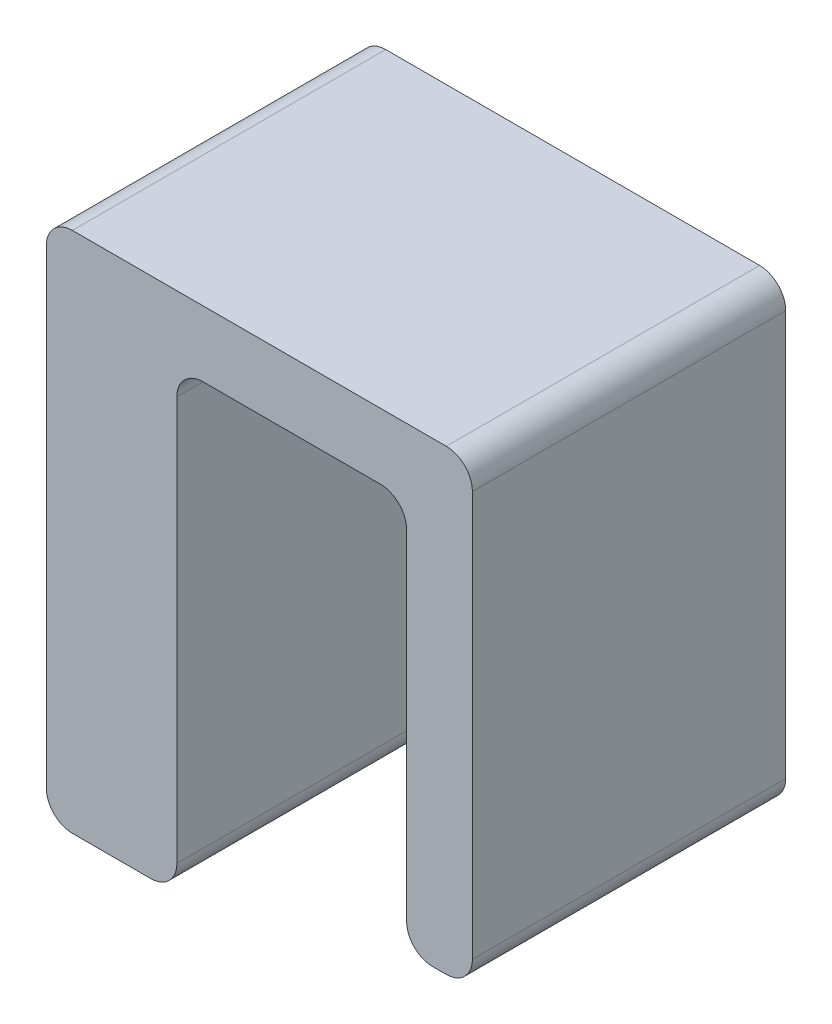
ISO-10303-21;
HEADER;
FILE_DESCRIPTION(('STEP AP214'),'2;1');
FILE_NAME('part.step','',(''),(''),'','','');
FILE_SCHEMA(('AUTOMOTIVE_DESIGN { 1 0 10303 214 1 1 1 1 }'));
ENDSEC;
DATA;
#1=APPLICATION_CONTEXT('core data for automotive mechanical design processes');
#2=APPLICATION_PROTOCOL_DEFINITION('international standard','automotive_design',2000,#1);
#3=PRODUCT_CONTEXT('',#1,'mechanical');
#4=PRODUCT('Part','Part','',(#3));
#5=PRODUCT_RELATED_PRODUCT_CATEGORY('part','',(#4));
#6=PRODUCT_DEFINITION_FORMATION('','',#4);
#7=PRODUCT_DEFINITION_CONTEXT('part definition',#1,'design');
#8=PRODUCT_DEFINITION('design','',#6,#7);
#9=PRODUCT_DEFINITION_SHAPE('','',#8);
#10=(LENGTH_UNIT() NAMED_UNIT(*) SI_UNIT(.MILLI.,.METRE.));
#11=(NAMED_UNIT(*) PLANE_ANGLE_UNIT() SI_UNIT($,.RADIAN.));
#12=(NAMED_UNIT(*) SI_UNIT($,.STERADIAN.) SOLID_ANGLE_UNIT());
#13=UNCERTAINTY_MEASURE_WITH_UNIT(LENGTH_MEASURE(1.E-05),#10,'distance_accuracy_value','');
#14=(GEOMETRIC_REPRESENTATION_CONTEXT(3) GLOBAL_UNCERTAINTY_ASSIGNED_CONTEXT((#13)) GLOBAL_UNIT_ASSIGNED_CONTEXT((#10,
#11,#12)) REPRESENTATION_CONTEXT('',''));
#15=CARTESIAN_POINT('',(0.,0.,0.));
#16=DIRECTION('',(0.,0.,1.));
#17=DIRECTION('',(1.,0.,0.));
#18=AXIS2_PLACEMENT_3D('',#15,#16,#17);
#19=CARTESIAN_POINT('',(3.175,0.,7.62));
#20=DIRECTION('',(0.,1.,0.));
#21=DIRECTION('',(-1.,0.,0.));
#22=AXIS2_PLACEMENT_3D('',#19,#20,#21);
#23=PLANE('',#22);
#24=DIRECTION('',(1.,0.,0.));
#25=VECTOR('',#24,1.);
#26=CARTESIAN_POINT('',(3.175,0.,0.));
#27=LINE('',#26,#25);
#28=CARTESIAN_POINT('',(0.635000000000001,0.,0.));
#29=VERTEX_POINT('',#28);
#30=CARTESIAN_POINT('',(2.54,0.,0.));
#31=VERTEX_POINT('',#30);
#32=EDGE_CURVE('E259',#29,#31,#27,.T.);
#33=ORIENTED_EDGE('',*,*,#32,.T.);
#34=DIRECTION('',(0.,0.,-1.));
#35=VECTOR('',#34,1.);
#36=CARTESIAN_POINT('',(2.54,0.,7.62));
#37=LINE('',#36,#35);
#38=CARTESIAN_POINT('',(2.54,0.,7.62));
#39=VERTEX_POINT('',#38);
#40=EDGE_CURVE('E219',#31,#39,#37,.F.);
#41=ORIENTED_EDGE('',*,*,#40,.T.);
#42=DIRECTION('',(1.,0.,0.));
#43=VECTOR('',#42,1.);
#44=CARTESIAN_POINT('',(3.175,0.,7.62));
#45=LINE('',#44,#43);
#46=CARTESIAN_POINT('',(0.635000000000001,0.,7.62));
#47=VERTEX_POINT('',#46);
#48=EDGE_CURVE('E194',#47,#39,#45,.T.);
#49=ORIENTED_EDGE('',*,*,#48,.F.);
#50=DIRECTION('',(0.,0.,-1.));
#51=VECTOR('',#50,1.);
#52=CARTESIAN_POINT('',(0.635000000000001,0.,7.62));
#53=LINE('',#52,#51);
#54=EDGE_CURVE('E216',#47,#29,#53,.T.);
#55=ORIENTED_EDGE('',*,*,#54,.T.);
#56=EDGE_LOOP('',(#33,#41,#49,#55));
#57=FACE_BOUND('',#56,.T.);
#58=ADVANCED_FACE('F35',(#57),#23,.F.);
#59=CARTESIAN_POINT('',(3.175,11.1,7.62));
#60=DIRECTION('',(-1.,0.,0.));
#61=DIRECTION('',(0.,-1.,0.));
#62=AXIS2_PLACEMENT_3D('',#59,#60,#61);
#63=PLANE('',#62);
#64=DIRECTION('',(0.,1.,0.));
#65=VECTOR('',#64,1.);
#66=CARTESIAN_POINT('',(3.175,11.1,0.));
#67=LINE('',#66,#65);
#68=CARTESIAN_POINT('',(3.175,0.635000000000002,0.));
#69=VERTEX_POINT('',#68);
#70=CARTESIAN_POINT('',(3.175,10.465,0.));
#71=VERTEX_POINT('',#70);
#72=EDGE_CURVE('E183',#69,#71,#67,.T.);
#73=ORIENTED_EDGE('',*,*,#72,.T.);
#74=DIRECTION('',(0.,0.,-1.));
#75=VECTOR('',#74,1.);
#76=CARTESIAN_POINT('',(3.175,10.465,7.62));
#77=LINE('',#76,#75);
#78=CARTESIAN_POINT('',(3.175,10.465,7.62));
#79=VERTEX_POINT('',#78);
#80=EDGE_CURVE('E203',#71,#79,#77,.F.);
#81=ORIENTED_EDGE('',*,*,#80,.T.);
#82=DIRECTION('',(0.,1.,0.));
#83=VECTOR('',#82,1.);
#84=CARTESIAN_POINT('',(3.175,11.1,7.62));
#85=LINE('',#84,#83);
#86=CARTESIAN_POINT('',(3.175,0.635000000000002,7.62));
#87=VERTEX_POINT('',#86);
#88=EDGE_CURVE('E267',#87,#79,#85,.T.);
#89=ORIENTED_EDGE('',*,*,#88,.F.);
#90=DIRECTION('',(0.,0.,-1.));
#91=VECTOR('',#90,1.);
#92=CARTESIAN_POINT('',(3.175,0.635000000000002,7.62));
#93=LINE('',#92,#91);
#94=EDGE_CURVE('E200',#87,#69,#93,.T.);
#95=ORIENTED_EDGE('',*,*,#94,.T.);
#96=EDGE_LOOP('',(#73,#81,#89,#95));
#97=FACE_BOUND('',#96,.T.);
#98=ADVANCED_FACE('F255',(#97),#63,.F.);
#99=CARTESIAN_POINT('',(8.763,11.1,7.62));
#100=DIRECTION('',(0.,1.,0.));
#101=DIRECTION('',(0.,0.,1.));
#102=AXIS2_PLACEMENT_3D('',#99,#100,#101);
#103=PLANE('',#102);
#104=DIRECTION('',(1.,0.,0.));
#105=VECTOR('',#104,1.);
#106=CARTESIAN_POINT('',(8.763,11.1,0.));
#107=LINE('',#106,#105);
#108=CARTESIAN_POINT('',(3.81,11.1,0.));
#109=VERTEX_POINT('',#108);
#110=CARTESIAN_POINT('',(8.128,11.1,0.));
#111=VERTEX_POINT('',#110);
#112=EDGE_CURVE('E178',#109,#111,#107,.T.);
#113=ORIENTED_EDGE('',*,*,#112,.T.);
#114=DIRECTION('',(0.,0.,-1.));
#115=VECTOR('',#114,1.);
#116=CARTESIAN_POINT('',(8.128,11.1,7.62));
#117=LINE('',#116,#115);
#118=CARTESIAN_POINT('',(8.128,11.1,7.62));
#119=VERTEX_POINT('',#118);
#120=EDGE_CURVE('E154',#111,#119,#117,.F.);
#121=ORIENTED_EDGE('',*,*,#120,.T.);
#122=DIRECTION('',(1.,0.,0.));
#123=VECTOR('',#122,1.);
#124=CARTESIAN_POINT('',(8.763,11.1,7.62));
#125=LINE('',#124,#123);
#126=CARTESIAN_POINT('',(3.81,11.1,7.62));
#127=VERTEX_POINT('',#126);
#128=EDGE_CURVE('E266',#127,#119,#125,.T.);
#129=ORIENTED_EDGE('',*,*,#128,.F.);
#130=DIRECTION('',(0.,0.,-1.));
#131=VECTOR('',#130,1.);
#132=CARTESIAN_POINT('',(3.81,11.1,0.));
#133=LINE('',#132,#131);
#134=EDGE_CURVE('E170',#127,#109,#133,.T.);
#135=ORIENTED_EDGE('',*,*,#134,.T.);
#136=EDGE_LOOP('',(#113,#121,#129,#135));
#137=FACE_BOUND('',#136,.T.);
#138=ADVANCED_FACE('F269',(#137),#103,.F.);
#139=CARTESIAN_POINT('',(8.763,1.575,7.62));
#140=DIRECTION('',(1.,0.,0.));
#141=DIRECTION('',(0.,0.,-1.));
#142=AXIS2_PLACEMENT_3D('',#139,#140,#141);
#143=PLANE('',#142);
#144=DIRECTION('',(0.,-1.,0.));
#145=VECTOR('',#144,1.);
#146=CARTESIAN_POINT('',(8.763,1.575,7.62));
#147=LINE('',#146,#145);
#148=CARTESIAN_POINT('',(8.763,10.465,7.62));
#149=VERTEX_POINT('',#148);
#150=CARTESIAN_POINT('',(8.763,2.21,7.62));
#151=VERTEX_POINT('',#150);
#152=EDGE_CURVE('E169',#149,#151,#147,.T.);
#153=ORIENTED_EDGE('',*,*,#152,.F.);
#154=DIRECTION('',(0.,0.,-1.));
#155=VECTOR('',#154,1.);
#156=CARTESIAN_POINT('',(8.763,10.465,0.));
#157=LINE('',#156,#155);
#158=CARTESIAN_POINT('',(8.763,10.465,0.));
#159=VERTEX_POINT('',#158);
#160=EDGE_CURVE('E153',#149,#159,#157,.T.);
#161=ORIENTED_EDGE('',*,*,#160,.T.);
#162=DIRECTION('',(0.,-1.,0.));
#163=VECTOR('',#162,1.);
#164=CARTESIAN_POINT('',(8.763,1.575,0.));
#165=LINE('',#164,#163);
#166=CARTESIAN_POINT('',(8.763,2.21,0.));
#167=VERTEX_POINT('',#166);
#168=EDGE_CURVE('E166',#159,#167,#165,.T.);
#169=ORIENTED_EDGE('',*,*,#168,.T.);
#170=DIRECTION('',(0.,0.,-1.));
#171=VECTOR('',#170,1.);
#172=CARTESIAN_POINT('',(8.763,2.21,7.62));
#173=LINE('',#172,#171);
#174=EDGE_CURVE('E171',#167,#151,#173,.F.);
#175=ORIENTED_EDGE('',*,*,#174,.T.);
#176=EDGE_LOOP('',(#153,#161,#169,#175));
#177=FACE_BOUND('',#176,.T.);
#178=ADVANCED_FACE('F165',(#177),#143,.F.);
#179=CARTESIAN_POINT('',(10.363,1.575,7.62));
#180=DIRECTION('',(0.,1.,0.));
#181=DIRECTION('',(-1.,0.,0.));
#182=AXIS2_PLACEMENT_3D('',#179,#180,#181);
#183=PLANE('',#182);
#184=DIRECTION('',(1.,0.,0.));
#185=VECTOR('',#184,1.);
#186=CARTESIAN_POINT('',(10.363,1.575,7.62));
#187=LINE('',#186,#185);
#188=CARTESIAN_POINT('',(9.398,1.575,7.62));
#189=VERTEX_POINT('',#188);
#190=CARTESIAN_POINT('',(9.728,1.575,7.62));
#191=VERTEX_POINT('',#190);
#192=EDGE_CURVE('E271',#189,#191,#187,.T.);
#193=ORIENTED_EDGE('',*,*,#192,.F.);
#194=DIRECTION('',(0.,0.,-1.));
#195=VECTOR('',#194,1.);
#196=CARTESIAN_POINT('',(9.398,1.575,7.62));
#197=LINE('',#196,#195);
#198=CARTESIAN_POINT('',(9.398,1.575,0.));
#199=VERTEX_POINT('',#198);
#200=EDGE_CURVE('E238',#189,#199,#197,.T.);
#201=ORIENTED_EDGE('',*,*,#200,.T.);
#202=DIRECTION('',(1.,0.,0.));
#203=VECTOR('',#202,1.);
#204=CARTESIAN_POINT('',(10.363,1.575,0.));
#205=LINE('',#204,#203);
#206=CARTESIAN_POINT('',(9.728,1.575,0.));
#207=VERTEX_POINT('',#206);
#208=EDGE_CURVE('E177',#199,#207,#205,.T.);
#209=ORIENTED_EDGE('',*,*,#208,.T.);
#210=DIRECTION('',(0.,0.,-1.));
#211=VECTOR('',#210,1.);
#212=CARTESIAN_POINT('',(9.728,1.575,7.62));
#213=LINE('',#212,#211);
#214=EDGE_CURVE('E236',#207,#191,#213,.F.);
#215=ORIENTED_EDGE('',*,*,#214,.T.);
#216=EDGE_LOOP('',(#193,#201,#209,#215));
#217=FACE_BOUND('',#216,.T.);
#218=ADVANCED_FACE('F321',(#217),#183,.F.);
#219=CARTESIAN_POINT('',(10.363,12.7,7.62));
#220=DIRECTION('',(-1.,0.,0.));
#221=DIRECTION('',(0.,-1.,0.));
#222=AXIS2_PLACEMENT_3D('',#219,#220,#221);
#223=PLANE('',#222);
#224=DIRECTION('',(0.,1.,0.));
#225=VECTOR('',#224,1.);
#226=CARTESIAN_POINT('',(10.363,12.7,7.62));
#227=LINE('',#226,#225);
#228=CARTESIAN_POINT('',(10.363,2.21,7.62));
#229=VERTEX_POINT('',#228);
#230=CARTESIAN_POINT('',(10.363,12.065,7.62));
#231=VERTEX_POINT('',#230);
#232=EDGE_CURVE('E278',#229,#231,#227,.T.);
#233=ORIENTED_EDGE('',*,*,#232,.F.);
#234=DIRECTION('',(0.,0.,-1.));
#235=VECTOR('',#234,1.);
#236=CARTESIAN_POINT('',(10.363,2.21,7.62));
#237=LINE('',#236,#235);
#238=CARTESIAN_POINT('',(10.363,2.21,0.));
#239=VERTEX_POINT('',#238);
#240=EDGE_CURVE('E243',#229,#239,#237,.T.);
#241=ORIENTED_EDGE('',*,*,#240,.T.);
#242=DIRECTION('',(0.,1.,0.));
#243=VECTOR('',#242,1.);
#244=CARTESIAN_POINT('',(10.363,12.7,0.));
#245=LINE('',#244,#243);
#246=CARTESIAN_POINT('',(10.363,12.065,0.));
#247=VERTEX_POINT('',#246);
#248=EDGE_CURVE('E181',#239,#247,#245,.T.);
#249=ORIENTED_EDGE('',*,*,#248,.T.);
#250=DIRECTION('',(0.,0.,-1.));
#251=VECTOR('',#250,1.);
#252=CARTESIAN_POINT('',(10.363,12.065,7.62));
#253=LINE('',#252,#251);
#254=EDGE_CURVE('E241',#247,#231,#253,.F.);
#255=ORIENTED_EDGE('',*,*,#254,.T.);
#256=EDGE_LOOP('',(#233,#241,#249,#255));
#257=FACE_BOUND('',#256,.T.);
#258=ADVANCED_FACE('F313',(#257),#223,.F.);
#259=CARTESIAN_POINT('',(0.,12.7,7.62));
#260=DIRECTION('',(0.,-1.,0.));
#261=DIRECTION('',(0.,0.,-1.));
#262=AXIS2_PLACEMENT_3D('',#259,#260,#261);
#263=PLANE('',#262);
#264=DIRECTION('',(-1.,0.,0.));
#265=VECTOR('',#264,1.);
#266=CARTESIAN_POINT('',(0.,12.7,0.));
#267=LINE('',#266,#265);
#268=CARTESIAN_POINT('',(9.728,12.7,0.));
#269=VERTEX_POINT('',#268);
#270=CARTESIAN_POINT('',(0.635,12.7,0.));
#271=VERTEX_POINT('',#270);
#272=EDGE_CURVE('E189',#269,#271,#267,.T.);
#273=ORIENTED_EDGE('',*,*,#272,.T.);
#274=DIRECTION('',(0.,0.,-1.));
#275=VECTOR('',#274,1.);
#276=CARTESIAN_POINT('',(0.635,12.7,7.62));
#277=LINE('',#276,#275);
#278=CARTESIAN_POINT('',(0.635,12.7,7.62));
#279=VERTEX_POINT('',#278);
#280=EDGE_CURVE('E160',#271,#279,#277,.F.);
#281=ORIENTED_EDGE('',*,*,#280,.T.);
#282=DIRECTION('',(-1.,0.,0.));
#283=VECTOR('',#282,1.);
#284=CARTESIAN_POINT('',(0.,12.7,7.62));
#285=LINE('',#284,#283);
#286=CARTESIAN_POINT('',(9.728,12.7,7.62));
#287=VERTEX_POINT('',#286);
#288=EDGE_CURVE('E281',#287,#279,#285,.T.);
#289=ORIENTED_EDGE('',*,*,#288,.F.);
#290=DIRECTION('',(0.,0.,-1.));
#291=VECTOR('',#290,1.);
#292=CARTESIAN_POINT('',(9.728,12.7,7.62));
#293=LINE('',#292,#291);
#294=EDGE_CURVE('E246',#287,#269,#293,.T.);
#295=ORIENTED_EDGE('',*,*,#294,.T.);
#296=EDGE_LOOP('',(#273,#281,#289,#295));
#297=FACE_BOUND('',#296,.T.);
#298=ADVANCED_FACE('F304',(#297),#263,.F.);
#299=CARTESIAN_POINT('',(0.,0.,7.62));
#300=DIRECTION('',(1.,0.,0.));
#301=DIRECTION('',(0.,0.,-1.));
#302=AXIS2_PLACEMENT_3D('',#299,#300,#301);
#303=PLANE('',#302);
#304=DIRECTION('',(0.,-1.,0.));
#305=VECTOR('',#304,1.);
#306=CARTESIAN_POINT('',(0.,0.,0.));
#307=LINE('',#306,#305);
#308=CARTESIAN_POINT('',(0.,12.065,0.));
#309=VERTEX_POINT('',#308);
#310=CARTESIAN_POINT('',(0.,0.635,0.));
#311=VERTEX_POINT('',#310);
#312=EDGE_CURVE('E192',#309,#311,#307,.T.);
#313=ORIENTED_EDGE('',*,*,#312,.T.);
#314=DIRECTION('',(0.,0.,-1.));
#315=VECTOR('',#314,1.);
#316=CARTESIAN_POINT('',(0.,0.635,7.62));
#317=LINE('',#316,#315);
#318=CARTESIAN_POINT('',(0.,0.635,7.62));
#319=VERTEX_POINT('',#318);
#320=EDGE_CURVE('E50',#311,#319,#317,.F.);
#321=ORIENTED_EDGE('',*,*,#320,.T.);
#322=DIRECTION('',(0.,-1.,0.));
#323=VECTOR('',#322,1.);
#324=CARTESIAN_POINT('',(0.,0.,7.62));
#325=LINE('',#324,#323);
#326=CARTESIAN_POINT('',(0.,12.065,7.62));
#327=VERTEX_POINT('',#326);
#328=EDGE_CURVE('E195',#327,#319,#325,.T.);
#329=ORIENTED_EDGE('',*,*,#328,.F.);
#330=DIRECTION('',(0.,0.,-1.));
#331=VECTOR('',#330,1.);
#332=CARTESIAN_POINT('',(0.,12.065,7.62));
#333=LINE('',#332,#331);
#334=EDGE_CURVE('E232',#327,#309,#333,.T.);
#335=ORIENTED_EDGE('',*,*,#334,.T.);
#336=EDGE_LOOP('',(#313,#321,#329,#335));
#337=FACE_BOUND('',#336,.T.);
#338=ADVANCED_FACE('F297',(#337),#303,.F.);
#339=CARTESIAN_POINT('',(0.,0.,7.62));
#340=DIRECTION('',(0.,0.,-1.));
#341=DIRECTION('',(-1.,0.,0.));
#342=AXIS2_PLACEMENT_3D('',#339,#340,#341);
#343=PLANE('',#342);
#344=ORIENTED_EDGE('',*,*,#48,.T.);
#345=CARTESIAN_POINT('',(2.54,0.635000000000002,7.62));
#346=DIRECTION('',(0.,0.,-1.));
#347=DIRECTION('',(-1.,0.,0.));
#348=AXIS2_PLACEMENT_3D('',#345,#346,#347);
#349=CIRCLE('',#348,0.635);
#350=EDGE_CURVE('E230',#39,#87,#349,.F.);
#351=ORIENTED_EDGE('',*,*,#350,.T.);
#352=ORIENTED_EDGE('',*,*,#88,.T.);
#353=CARTESIAN_POINT('',(3.81,10.465,7.62));
#354=DIRECTION('',(0.,0.,-1.));
#355=DIRECTION('',(-1.,0.,0.));
#356=AXIS2_PLACEMENT_3D('',#353,#354,#355);
#357=CIRCLE('',#356,0.635);
#358=EDGE_CURVE('E11',#79,#127,#357,.T.);
#359=ORIENTED_EDGE('',*,*,#358,.T.);
#360=ORIENTED_EDGE('',*,*,#128,.T.);
#361=CARTESIAN_POINT('',(8.128,10.465,7.62));
#362=DIRECTION('',(0.,0.,-1.));
#363=DIRECTION('',(-1.,0.,0.));
#364=AXIS2_PLACEMENT_3D('',#361,#362,#363);
#365=CIRCLE('',#364,0.635);
#366=EDGE_CURVE('E159',#119,#149,#365,.T.);
#367=ORIENTED_EDGE('',*,*,#366,.T.);
#368=ORIENTED_EDGE('',*,*,#152,.T.);
#369=CARTESIAN_POINT('',(9.398,2.21,7.62));
#370=DIRECTION('',(0.,0.,-1.));
#371=DIRECTION('',(-1.,0.,0.));
#372=AXIS2_PLACEMENT_3D('',#369,#370,#371);
#373=CIRCLE('',#372,0.635);
#374=EDGE_CURVE('E226',#151,#189,#373,.F.);
#375=ORIENTED_EDGE('',*,*,#374,.T.);
#376=ORIENTED_EDGE('',*,*,#192,.T.);
#377=CARTESIAN_POINT('',(9.728,2.21,7.62));
#378=DIRECTION('',(0.,0.,-1.));
#379=DIRECTION('',(-1.,0.,0.));
#380=AXIS2_PLACEMENT_3D('',#377,#378,#379);
#381=CIRCLE('',#380,0.635);
#382=EDGE_CURVE('E224',#191,#229,#381,.F.);
#383=ORIENTED_EDGE('',*,*,#382,.T.);
#384=ORIENTED_EDGE('',*,*,#232,.T.);
#385=CARTESIAN_POINT('',(9.728,12.065,7.62));
#386=DIRECTION('',(0.,0.,-1.));
#387=DIRECTION('',(-1.,0.,0.));
#388=AXIS2_PLACEMENT_3D('',#385,#386,#387);
#389=CIRCLE('',#388,0.635);
#390=EDGE_CURVE('E221',#231,#287,#389,.F.);
#391=ORIENTED_EDGE('',*,*,#390,.T.);
#392=ORIENTED_EDGE('',*,*,#288,.T.);
#393=CARTESIAN_POINT('',(0.635,12.065,7.62));
#394=DIRECTION('',(0.,0.,-1.));
#395=DIRECTION('',(-1.,0.,0.));
#396=AXIS2_PLACEMENT_3D('',#393,#394,#395);
#397=CIRCLE('',#396,0.635);
#398=EDGE_CURVE('E57',#279,#327,#397,.F.);
#399=ORIENTED_EDGE('',*,*,#398,.T.);
#400=ORIENTED_EDGE('',*,*,#328,.T.);
#401=CARTESIAN_POINT('',(0.635000000000001,0.635,7.62));
#402=DIRECTION('',(0.,0.,-1.));
#403=DIRECTION('',(-1.,0.,0.));
#404=AXIS2_PLACEMENT_3D('',#401,#402,#403);
#405=CIRCLE('',#404,0.635);
#406=EDGE_CURVE('E228',#319,#47,#405,.F.);
#407=ORIENTED_EDGE('',*,*,#406,.T.);
#408=EDGE_LOOP('',(#344,#351,#352,#359,#360,#367,#368,#375,#376,#383,#384,#391,#392,#399,#400,#407));
#409=FACE_BOUND('',#408,.T.);
#410=ADVANCED_FACE('F265',(#409),#343,.F.);
#411=CARTESIAN_POINT('',(0.,0.,0.));
#412=DIRECTION('',(0.,0.,-1.));
#413=DIRECTION('',(-1.,0.,0.));
#414=AXIS2_PLACEMENT_3D('',#411,#412,#413);
#415=PLANE('',#414);
#416=ORIENTED_EDGE('',*,*,#72,.F.);
#417=CARTESIAN_POINT('',(2.54,0.635000000000002,0.));
#418=DIRECTION('',(0.,0.,-1.));
#419=DIRECTION('',(-1.,0.,0.));
#420=AXIS2_PLACEMENT_3D('',#417,#418,#419);
#421=CIRCLE('',#420,0.635);
#422=EDGE_CURVE('E214',#69,#31,#421,.T.);
#423=ORIENTED_EDGE('',*,*,#422,.T.);
#424=ORIENTED_EDGE('',*,*,#32,.F.);
#425=CARTESIAN_POINT('',(0.635000000000001,0.635,0.));
#426=DIRECTION('',(0.,0.,-1.));
#427=DIRECTION('',(-1.,0.,0.));
#428=AXIS2_PLACEMENT_3D('',#425,#426,#427);
#429=CIRCLE('',#428,0.635);
#430=EDGE_CURVE('E212',#29,#311,#429,.T.);
#431=ORIENTED_EDGE('',*,*,#430,.T.);
#432=ORIENTED_EDGE('',*,*,#312,.F.);
#433=CARTESIAN_POINT('',(0.635,12.065,0.));
#434=DIRECTION('',(0.,0.,-1.));
#435=DIRECTION('',(-1.,0.,0.));
#436=AXIS2_PLACEMENT_3D('',#433,#434,#435);
#437=CIRCLE('',#436,0.635);
#438=EDGE_CURVE('E207',#309,#271,#437,.T.);
#439=ORIENTED_EDGE('',*,*,#438,.T.);
#440=ORIENTED_EDGE('',*,*,#272,.F.);
#441=CARTESIAN_POINT('',(9.728,12.065,0.));
#442=DIRECTION('',(0.,0.,-1.));
#443=DIRECTION('',(-1.,0.,0.));
#444=AXIS2_PLACEMENT_3D('',#441,#442,#443);
#445=CIRCLE('',#444,0.635);
#446=EDGE_CURVE('E205',#269,#247,#445,.T.);
#447=ORIENTED_EDGE('',*,*,#446,.T.);
#448=ORIENTED_EDGE('',*,*,#248,.F.);
#449=CARTESIAN_POINT('',(9.728,2.21,0.));
#450=DIRECTION('',(0.,0.,-1.));
#451=DIRECTION('',(-1.,0.,0.));
#452=AXIS2_PLACEMENT_3D('',#449,#450,#451);
#453=CIRCLE('',#452,0.635);
#454=EDGE_CURVE('E209',#239,#207,#453,.T.);
#455=ORIENTED_EDGE('',*,*,#454,.T.);
#456=ORIENTED_EDGE('',*,*,#208,.F.);
#457=CARTESIAN_POINT('',(9.398,2.21,0.));
#458=DIRECTION('',(0.,0.,-1.));
#459=DIRECTION('',(-1.,0.,0.));
#460=AXIS2_PLACEMENT_3D('',#457,#458,#459);
#461=CIRCLE('',#460,0.635);
#462=EDGE_CURVE('E176',#199,#167,#461,.T.);
#463=ORIENTED_EDGE('',*,*,#462,.T.);
#464=ORIENTED_EDGE('',*,*,#168,.F.);
#465=CARTESIAN_POINT('',(8.128,10.465,0.));
#466=DIRECTION('',(0.,0.,-1.));
#467=DIRECTION('',(-1.,0.,0.));
#468=AXIS2_PLACEMENT_3D('',#465,#466,#467);
#469=CIRCLE('',#468,0.635);
#470=EDGE_CURVE('E149',#159,#111,#469,.F.);
#471=ORIENTED_EDGE('',*,*,#470,.T.);
#472=ORIENTED_EDGE('',*,*,#112,.F.);
#473=CARTESIAN_POINT('',(3.81,10.465,0.));
#474=DIRECTION('',(0.,0.,-1.));
#475=DIRECTION('',(-1.,0.,0.));
#476=AXIS2_PLACEMENT_3D('',#473,#474,#475);
#477=CIRCLE('',#476,0.635);
#478=EDGE_CURVE('E43',#109,#71,#477,.F.);
#479=ORIENTED_EDGE('',*,*,#478,.T.);
#480=EDGE_LOOP('',(#416,#423,#424,#431,#432,#439,#440,#447,#448,#455,#456,#463,#464,#471,#472,#479));
#481=FACE_BOUND('',#480,.T.);
#482=ADVANCED_FACE('F174',(#481),#415,.T.);
#483=CARTESIAN_POINT('',(8.128,10.465,7.62));
#484=DIRECTION('',(0.,0.,1.));
#485=DIRECTION('',(1.,0.,0.));
#486=AXIS2_PLACEMENT_3D('',#483,#484,#485);
#487=CYLINDRICAL_SURFACE('',#486,0.635);
#488=ORIENTED_EDGE('',*,*,#366,.F.);
#489=ORIENTED_EDGE('',*,*,#120,.F.);
#490=ORIENTED_EDGE('',*,*,#470,.F.);
#491=ORIENTED_EDGE('',*,*,#160,.F.);
#492=EDGE_LOOP('',(#488,#489,#490,#491));
#493=FACE_BOUND('',#492,.T.);
#494=ADVANCED_FACE('F152',(#493),#487,.F.);
#495=CARTESIAN_POINT('',(3.81,10.465,7.62));
#496=DIRECTION('',(0.,0.,1.));
#497=DIRECTION('',(1.,0.,0.));
#498=AXIS2_PLACEMENT_3D('',#495,#496,#497);
#499=CYLINDRICAL_SURFACE('',#498,0.635);
#500=ORIENTED_EDGE('',*,*,#358,.F.);
#501=ORIENTED_EDGE('',*,*,#80,.F.);
#502=ORIENTED_EDGE('',*,*,#478,.F.);
#503=ORIENTED_EDGE('',*,*,#134,.F.);
#504=EDGE_LOOP('',(#500,#501,#502,#503));
#505=FACE_BOUND('',#504,.T.);
#506=ADVANCED_FACE('F261',(#505),#499,.F.);
#507=CARTESIAN_POINT('',(2.54,0.635000000000002,7.62));
#508=DIRECTION('',(0.,0.,-1.));
#509=DIRECTION('',(-1.,0.,0.));
#510=AXIS2_PLACEMENT_3D('',#507,#508,#509);
#511=CYLINDRICAL_SURFACE('',#510,0.635);
#512=ORIENTED_EDGE('',*,*,#350,.F.);
#513=ORIENTED_EDGE('',*,*,#40,.F.);
#514=ORIENTED_EDGE('',*,*,#422,.F.);
#515=ORIENTED_EDGE('',*,*,#94,.F.);
#516=EDGE_LOOP('',(#512,#513,#514,#515));
#517=FACE_BOUND('',#516,.T.);
#518=ADVANCED_FACE('F292',(#517),#511,.T.);
#519=CARTESIAN_POINT('',(0.635000000000001,0.635,7.62));
#520=DIRECTION('',(0.,0.,-1.));
#521=DIRECTION('',(-1.,0.,0.));
#522=AXIS2_PLACEMENT_3D('',#519,#520,#521);
#523=CYLINDRICAL_SURFACE('',#522,0.635);
#524=ORIENTED_EDGE('',*,*,#406,.F.);
#525=ORIENTED_EDGE('',*,*,#320,.F.);
#526=ORIENTED_EDGE('',*,*,#430,.F.);
#527=ORIENTED_EDGE('',*,*,#54,.F.);
#528=EDGE_LOOP('',(#524,#525,#526,#527));
#529=FACE_BOUND('',#528,.T.);
#530=ADVANCED_FACE('F295',(#529),#523,.T.);
#531=CARTESIAN_POINT('',(9.398,2.21,7.62));
#532=DIRECTION('',(0.,0.,-1.));
#533=DIRECTION('',(-1.,0.,0.));
#534=AXIS2_PLACEMENT_3D('',#531,#532,#533);
#535=CYLINDRICAL_SURFACE('',#534,0.635);
#536=ORIENTED_EDGE('',*,*,#374,.F.);
#537=ORIENTED_EDGE('',*,*,#174,.F.);
#538=ORIENTED_EDGE('',*,*,#462,.F.);
#539=ORIENTED_EDGE('',*,*,#200,.F.);
#540=EDGE_LOOP('',(#536,#537,#538,#539));
#541=FACE_BOUND('',#540,.T.);
#542=ADVANCED_FACE('F325',(#541),#535,.T.);
#543=CARTESIAN_POINT('',(9.728,2.21,7.62));
#544=DIRECTION('',(0.,0.,-1.));
#545=DIRECTION('',(-1.,0.,0.));
#546=AXIS2_PLACEMENT_3D('',#543,#544,#545);
#547=CYLINDRICAL_SURFACE('',#546,0.635);
#548=ORIENTED_EDGE('',*,*,#382,.F.);
#549=ORIENTED_EDGE('',*,*,#214,.F.);
#550=ORIENTED_EDGE('',*,*,#454,.F.);
#551=ORIENTED_EDGE('',*,*,#240,.F.);
#552=EDGE_LOOP('',(#548,#549,#550,#551));
#553=FACE_BOUND('',#552,.T.);
#554=ADVANCED_FACE('F317',(#553),#547,.T.);
#555=CARTESIAN_POINT('',(0.635,12.065,7.62));
#556=DIRECTION('',(0.,0.,-1.));
#557=DIRECTION('',(-1.,0.,0.));
#558=AXIS2_PLACEMENT_3D('',#555,#556,#557);
#559=CYLINDRICAL_SURFACE('',#558,0.635);
#560=ORIENTED_EDGE('',*,*,#398,.F.);
#561=ORIENTED_EDGE('',*,*,#280,.F.);
#562=ORIENTED_EDGE('',*,*,#438,.F.);
#563=ORIENTED_EDGE('',*,*,#334,.F.);
#564=EDGE_LOOP('',(#560,#561,#562,#563));
#565=FACE_BOUND('',#564,.T.);
#566=ADVANCED_FACE('F300',(#565),#559,.T.);
#567=CARTESIAN_POINT('',(9.728,12.065,7.62));
#568=DIRECTION('',(0.,0.,-1.));
#569=DIRECTION('',(-1.,0.,0.));
#570=AXIS2_PLACEMENT_3D('',#567,#568,#569);
#571=CYLINDRICAL_SURFACE('',#570,0.635);
#572=ORIENTED_EDGE('',*,*,#390,.F.);
#573=ORIENTED_EDGE('',*,*,#254,.F.);
#574=ORIENTED_EDGE('',*,*,#446,.F.);
#575=ORIENTED_EDGE('',*,*,#294,.F.);
#576=EDGE_LOOP('',(#572,#573,#574,#575));
#577=FACE_BOUND('',#576,.T.);
#578=ADVANCED_FACE('F37',(#577),#571,.T.);
#579=CLOSED_SHELL('',(#58,#98,#138,#178,#218,#258,#298,#338,#410,#482,#494,#506,#518,#530,#542,
#554,#566,#578));
#580=MANIFOLD_SOLID_BREP('B2',#579);
#581=ADVANCED_BREP_SHAPE_REPRESENTATION('',(#18,#580),#14);
#582=SHAPE_DEFINITION_REPRESENTATION(#9,#581);
ENDSEC;
END-ISO-10303-21;
